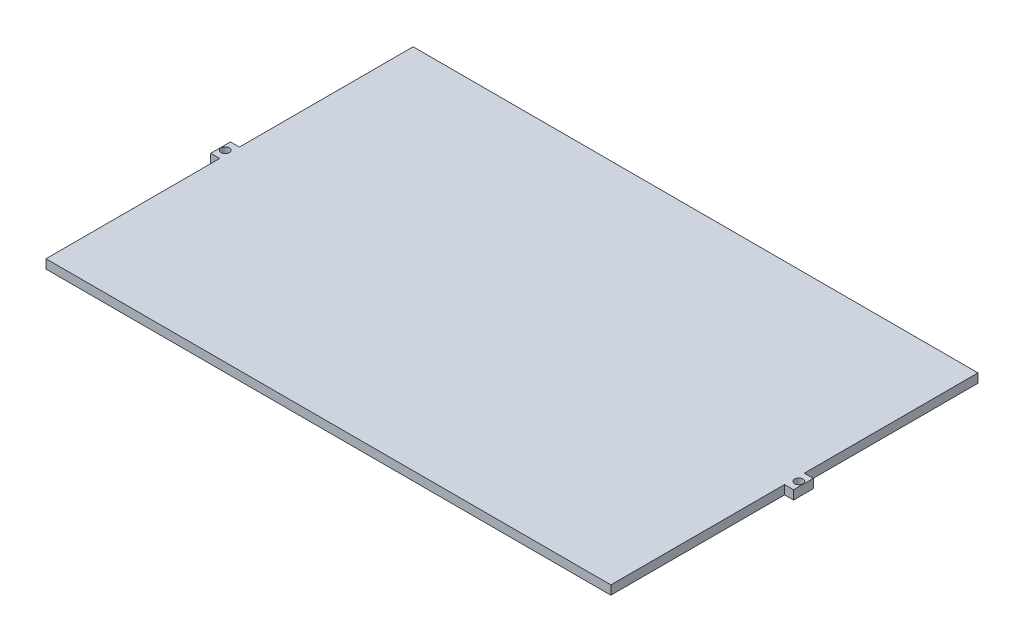
ISO-10303-21;
HEADER;
FILE_DESCRIPTION(('STEP AP214'),'2;1');
FILE_NAME('part.step','',(''),(''),'','','');
FILE_SCHEMA(('AUTOMOTIVE_DESIGN { 1 0 10303 214 1 1 1 1 }'));
ENDSEC;
DATA;
#1=APPLICATION_CONTEXT('core data for automotive mechanical design processes');
#2=APPLICATION_PROTOCOL_DEFINITION('international standard','automotive_design',2000,#1);
#3=PRODUCT_CONTEXT('',#1,'mechanical');
#4=PRODUCT('Part','Part','',(#3));
#5=PRODUCT_RELATED_PRODUCT_CATEGORY('part','',(#4));
#6=PRODUCT_DEFINITION_FORMATION('','',#4);
#7=PRODUCT_DEFINITION_CONTEXT('part definition',#1,'design');
#8=PRODUCT_DEFINITION('design','',#6,#7);
#9=PRODUCT_DEFINITION_SHAPE('','',#8);
#10=(LENGTH_UNIT() NAMED_UNIT(*) SI_UNIT(.MILLI.,.METRE.));
#11=(NAMED_UNIT(*) PLANE_ANGLE_UNIT() SI_UNIT($,.RADIAN.));
#12=(NAMED_UNIT(*) SI_UNIT($,.STERADIAN.) SOLID_ANGLE_UNIT());
#13=UNCERTAINTY_MEASURE_WITH_UNIT(LENGTH_MEASURE(1.E-05),#10,'distance_accuracy_value','');
#14=(GEOMETRIC_REPRESENTATION_CONTEXT(3) GLOBAL_UNCERTAINTY_ASSIGNED_CONTEXT((#13)) GLOBAL_UNIT_ASSIGNED_CONTEXT((#10,
#11,#12)) REPRESENTATION_CONTEXT('',''));
#15=CARTESIAN_POINT('',(0.,0.,0.));
#16=DIRECTION('',(0.,0.,1.));
#17=DIRECTION('',(1.,0.,0.));
#18=AXIS2_PLACEMENT_3D('',#15,#16,#17);
#19=CARTESIAN_POINT('',(99.9999999999999,3.18,-65.));
#20=DIRECTION('',(-1.,0.,0.));
#21=DIRECTION('',(0.,0.,1.));
#22=AXIS2_PLACEMENT_3D('',#19,#20,#21);
#23=PLANE('',#22);
#24=DIRECTION('',(0.,0.,-1.));
#25=VECTOR('',#24,1.);
#26=CARTESIAN_POINT('',(99.9999999999999,3.18,-65.));
#27=LINE('',#26,#25);
#28=CARTESIAN_POINT('',(100.,3.18,-3.49999999999998));
#29=VERTEX_POINT('',#28);
#30=CARTESIAN_POINT('',(99.9999999999999,3.18,-65.));
#31=VERTEX_POINT('',#30);
#32=EDGE_CURVE('E196',#29,#31,#27,.T.);
#33=ORIENTED_EDGE('',*,*,#32,.F.);
#34=DIRECTION('',(0.,-1.,0.));
#35=VECTOR('',#34,1.);
#36=CARTESIAN_POINT('',(100.,0.,-3.49999999999998));
#37=LINE('',#36,#35);
#38=CARTESIAN_POINT('',(100.,0.,-3.49999999999998));
#39=VERTEX_POINT('',#38);
#40=EDGE_CURVE('E131',#29,#39,#37,.T.);
#41=ORIENTED_EDGE('',*,*,#40,.T.);
#42=DIRECTION('',(0.,0.,-1.));
#43=VECTOR('',#42,1.);
#44=CARTESIAN_POINT('',(99.9999999999999,0.,-65.));
#45=LINE('',#44,#43);
#46=CARTESIAN_POINT('',(99.9999999999999,0.,-65.));
#47=VERTEX_POINT('',#46);
#48=EDGE_CURVE('E192',#39,#47,#45,.T.);
#49=ORIENTED_EDGE('',*,*,#48,.T.);
#50=DIRECTION('',(0.,-1.,0.));
#51=VECTOR('',#50,1.);
#52=CARTESIAN_POINT('',(99.9999999999999,3.18,-65.));
#53=LINE('',#52,#51);
#54=EDGE_CURVE('E11',#31,#47,#53,.T.);
#55=ORIENTED_EDGE('',*,*,#54,.F.);
#56=EDGE_LOOP('',(#33,#41,#49,#55));
#57=FACE_BOUND('',#56,.T.);
#58=ADVANCED_FACE('F34',(#57),#23,.F.);
#59=CARTESIAN_POINT('',(-100.,3.18,-65.));
#60=DIRECTION('',(1.,0.,0.));
#61=DIRECTION('',(0.,0.,-1.));
#62=AXIS2_PLACEMENT_3D('',#59,#60,#61);
#63=PLANE('',#62);
#64=DIRECTION('',(0.,-1.,0.));
#65=VECTOR('',#64,1.);
#66=CARTESIAN_POINT('',(-100.,0.,-3.49999999999998));
#67=LINE('',#66,#65);
#68=CARTESIAN_POINT('',(-100.,3.18,-3.49999999999998));
#69=VERTEX_POINT('',#68);
#70=CARTESIAN_POINT('',(-100.,0.,-3.49999999999998));
#71=VERTEX_POINT('',#70);
#72=EDGE_CURVE('E57',#69,#71,#67,.T.);
#73=ORIENTED_EDGE('',*,*,#72,.F.);
#74=DIRECTION('',(0.,0.,1.));
#75=VECTOR('',#74,1.);
#76=CARTESIAN_POINT('',(-100.,3.18,-65.));
#77=LINE('',#76,#75);
#78=CARTESIAN_POINT('',(-100.,3.18,-65.));
#79=VERTEX_POINT('',#78);
#80=EDGE_CURVE('E199',#79,#69,#77,.T.);
#81=ORIENTED_EDGE('',*,*,#80,.F.);
#82=DIRECTION('',(0.,-1.,0.));
#83=VECTOR('',#82,1.);
#84=CARTESIAN_POINT('',(-100.,3.18,-65.));
#85=LINE('',#84,#83);
#86=CARTESIAN_POINT('',(-100.,0.,-65.));
#87=VERTEX_POINT('',#86);
#88=EDGE_CURVE('E42',#79,#87,#85,.T.);
#89=ORIENTED_EDGE('',*,*,#88,.T.);
#90=DIRECTION('',(0.,0.,1.));
#91=VECTOR('',#90,1.);
#92=CARTESIAN_POINT('',(-100.,0.,-65.));
#93=LINE('',#92,#91);
#94=EDGE_CURVE('E210',#87,#71,#93,.T.);
#95=ORIENTED_EDGE('',*,*,#94,.T.);
#96=EDGE_LOOP('',(#73,#81,#89,#95));
#97=FACE_BOUND('',#96,.T.);
#98=ADVANCED_FACE('F221',(#97),#63,.F.);
#99=DIRECTION('',(0.,1.,0.));
#100=VECTOR('',#99,1.);
#101=CARTESIAN_POINT('',(-100.,0.,3.50000000000002));
#102=LINE('',#101,#100);
#103=CARTESIAN_POINT('',(-100.,0.,3.50000000000002));
#104=VERTEX_POINT('',#103);
#105=CARTESIAN_POINT('',(-100.,3.18,3.50000000000002));
#106=VERTEX_POINT('',#105);
#107=EDGE_CURVE('E171',#104,#106,#102,.T.);
#108=ORIENTED_EDGE('',*,*,#107,.F.);
#109=CARTESIAN_POINT('',(-100.,0.,65.));
#110=VERTEX_POINT('',#109);
#111=EDGE_CURVE('E209',#104,#110,#93,.T.);
#112=ORIENTED_EDGE('',*,*,#111,.T.);
#113=DIRECTION('',(0.,-1.,0.));
#114=VECTOR('',#113,1.);
#115=CARTESIAN_POINT('',(-100.,3.18,65.));
#116=LINE('',#115,#114);
#117=CARTESIAN_POINT('',(-100.,3.18,65.));
#118=VERTEX_POINT('',#117);
#119=EDGE_CURVE('E216',#118,#110,#116,.T.);
#120=ORIENTED_EDGE('',*,*,#119,.F.);
#121=EDGE_CURVE('E198',#106,#118,#77,.T.);
#122=ORIENTED_EDGE('',*,*,#121,.F.);
#123=EDGE_LOOP('',(#108,#112,#120,#122));
#124=FACE_BOUND('',#123,.T.);
#125=ADVANCED_FACE('F270',(#124),#63,.F.);
#126=CARTESIAN_POINT('',(100.,0.,65.));
#127=VERTEX_POINT('',#126);
#128=CARTESIAN_POINT('',(100.,0.,3.50000000000002));
#129=VERTEX_POINT('',#128);
#130=EDGE_CURVE('E204',#127,#129,#45,.T.);
#131=ORIENTED_EDGE('',*,*,#130,.T.);
#132=DIRECTION('',(0.,1.,0.));
#133=VECTOR('',#132,1.);
#134=CARTESIAN_POINT('',(100.,0.,3.50000000000002));
#135=LINE('',#134,#133);
#136=CARTESIAN_POINT('',(100.,3.18,3.50000000000002));
#137=VERTEX_POINT('',#136);
#138=EDGE_CURVE('E144',#129,#137,#135,.T.);
#139=ORIENTED_EDGE('',*,*,#138,.T.);
#140=CARTESIAN_POINT('',(100.,3.18,65.));
#141=VERTEX_POINT('',#140);
#142=EDGE_CURVE('E193',#141,#137,#27,.T.);
#143=ORIENTED_EDGE('',*,*,#142,.F.);
#144=DIRECTION('',(0.,-1.,0.));
#145=VECTOR('',#144,1.);
#146=CARTESIAN_POINT('',(100.,3.18,65.));
#147=LINE('',#146,#145);
#148=EDGE_CURVE('E203',#141,#127,#147,.T.);
#149=ORIENTED_EDGE('',*,*,#148,.T.);
#150=EDGE_LOOP('',(#131,#139,#143,#149));
#151=FACE_BOUND('',#150,.T.);
#152=ADVANCED_FACE('F36',(#151),#23,.F.);
#153=CARTESIAN_POINT('',(-100.,3.18,-65.));
#154=DIRECTION('',(0.,0.,1.));
#155=DIRECTION('',(1.,0.,0.));
#156=AXIS2_PLACEMENT_3D('',#153,#154,#155);
#157=PLANE('',#156);
#158=DIRECTION('',(-1.,0.,0.));
#159=VECTOR('',#158,1.);
#160=CARTESIAN_POINT('',(-100.,0.,-65.));
#161=LINE('',#160,#159);
#162=EDGE_CURVE('E207',#47,#87,#161,.T.);
#163=ORIENTED_EDGE('',*,*,#162,.T.);
#164=ORIENTED_EDGE('',*,*,#88,.F.);
#165=DIRECTION('',(-1.,0.,0.));
#166=VECTOR('',#165,1.);
#167=CARTESIAN_POINT('',(-100.,3.18,-65.));
#168=LINE('',#167,#166);
#169=EDGE_CURVE('E195',#31,#79,#168,.T.);
#170=ORIENTED_EDGE('',*,*,#169,.F.);
#171=ORIENTED_EDGE('',*,*,#54,.T.);
#172=EDGE_LOOP('',(#163,#164,#170,#171));
#173=FACE_BOUND('',#172,.T.);
#174=ADVANCED_FACE('F237',(#173),#157,.F.);
#175=CARTESIAN_POINT('',(-100.,3.18,65.));
#176=DIRECTION('',(0.,0.,-1.));
#177=DIRECTION('',(-1.,0.,0.));
#178=AXIS2_PLACEMENT_3D('',#175,#176,#177);
#179=PLANE('',#178);
#180=DIRECTION('',(1.,0.,0.));
#181=VECTOR('',#180,1.);
#182=CARTESIAN_POINT('',(-100.,0.,65.));
#183=LINE('',#182,#181);
#184=EDGE_CURVE('E212',#110,#127,#183,.T.);
#185=ORIENTED_EDGE('',*,*,#184,.T.);
#186=ORIENTED_EDGE('',*,*,#148,.F.);
#187=DIRECTION('',(1.,0.,0.));
#188=VECTOR('',#187,1.);
#189=CARTESIAN_POINT('',(-100.,3.18,65.));
#190=LINE('',#189,#188);
#191=EDGE_CURVE('E201',#118,#141,#190,.T.);
#192=ORIENTED_EDGE('',*,*,#191,.F.);
#193=ORIENTED_EDGE('',*,*,#119,.T.);
#194=EDGE_LOOP('',(#185,#186,#192,#193));
#195=FACE_BOUND('',#194,.T.);
#196=ADVANCED_FACE('F246',(#195),#179,.F.);
#197=CARTESIAN_POINT('',(0.,3.18,0.));
#198=DIRECTION('',(0.,1.,0.));
#199=DIRECTION('',(0.,0.,1.));
#200=AXIS2_PLACEMENT_3D('',#197,#198,#199);
#201=PLANE('',#200);
#202=CARTESIAN_POINT('',(101.55,3.18,0.));
#203=DIRECTION('',(0.,-1.,0.));
#204=DIRECTION('',(0.,0.,1.));
#205=AXIS2_PLACEMENT_3D('',#202,#203,#204);
#206=CIRCLE('',#205,1.46999999999999);
#207=CARTESIAN_POINT('',(101.55,3.18,1.46999999999999));
#208=VERTEX_POINT('',#207);
#209=EDGE_CURVE('E371',#208,#208,#206,.T.);
#210=ORIENTED_EDGE('',*,*,#209,.T.);
#211=EDGE_LOOP('',(#210));
#212=FACE_BOUND('',#211,.T.);
#213=CARTESIAN_POINT('',(-101.55,3.18,0.));
#214=DIRECTION('',(0.,1.,0.));
#215=DIRECTION('',(0.,0.,1.));
#216=AXIS2_PLACEMENT_3D('',#213,#214,#215);
#217=CIRCLE('',#216,1.46999999999999);
#218=CARTESIAN_POINT('',(-101.55,3.18,1.46999999999999));
#219=VERTEX_POINT('',#218);
#220=EDGE_CURVE('E135',#219,#219,#217,.T.);
#221=ORIENTED_EDGE('',*,*,#220,.F.);
#222=EDGE_LOOP('',(#221));
#223=FACE_BOUND('',#222,.T.);
#224=ORIENTED_EDGE('',*,*,#142,.T.);
#225=DIRECTION('',(-1.,0.,0.));
#226=VECTOR('',#225,1.);
#227=CARTESIAN_POINT('',(103.18,3.18,3.50000000000002));
#228=LINE('',#227,#226);
#229=CARTESIAN_POINT('',(103.18,3.18,3.50000000000002));
#230=VERTEX_POINT('',#229);
#231=EDGE_CURVE('E49',#230,#137,#228,.T.);
#232=ORIENTED_EDGE('',*,*,#231,.F.);
#233=DIRECTION('',(0.,0.,-1.));
#234=VECTOR('',#233,1.);
#235=CARTESIAN_POINT('',(103.18,3.18,3.50000000000002));
#236=LINE('',#235,#234);
#237=CARTESIAN_POINT('',(103.18,3.18,-3.49999999999998));
#238=VERTEX_POINT('',#237);
#239=EDGE_CURVE('E141',#230,#238,#236,.T.);
#240=ORIENTED_EDGE('',*,*,#239,.T.);
#241=DIRECTION('',(-1.,0.,0.));
#242=VECTOR('',#241,1.);
#243=CARTESIAN_POINT('',(103.18,3.18,-3.49999999999998));
#244=LINE('',#243,#242);
#245=EDGE_CURVE('E125',#238,#29,#244,.T.);
#246=ORIENTED_EDGE('',*,*,#245,.T.);
#247=ORIENTED_EDGE('',*,*,#32,.T.);
#248=ORIENTED_EDGE('',*,*,#169,.T.);
#249=ORIENTED_EDGE('',*,*,#80,.T.);
#250=DIRECTION('',(1.,0.,0.));
#251=VECTOR('',#250,1.);
#252=CARTESIAN_POINT('',(-103.18,3.18,-3.49999999999998));
#253=LINE('',#252,#251);
#254=CARTESIAN_POINT('',(-103.18,3.18,-3.49999999999998));
#255=VERTEX_POINT('',#254);
#256=EDGE_CURVE('E177',#255,#69,#253,.T.);
#257=ORIENTED_EDGE('',*,*,#256,.F.);
#258=DIRECTION('',(0.,0.,-1.));
#259=VECTOR('',#258,1.);
#260=CARTESIAN_POINT('',(-103.18,3.18,3.50000000000002));
#261=LINE('',#260,#259);
#262=CARTESIAN_POINT('',(-103.18,3.18,3.50000000000002));
#263=VERTEX_POINT('',#262);
#264=EDGE_CURVE('E175',#263,#255,#261,.T.);
#265=ORIENTED_EDGE('',*,*,#264,.F.);
#266=DIRECTION('',(1.,0.,0.));
#267=VECTOR('',#266,1.);
#268=CARTESIAN_POINT('',(-103.18,3.18,3.50000000000002));
#269=LINE('',#268,#267);
#270=EDGE_CURVE('E183',#263,#106,#269,.T.);
#271=ORIENTED_EDGE('',*,*,#270,.T.);
#272=ORIENTED_EDGE('',*,*,#121,.T.);
#273=ORIENTED_EDGE('',*,*,#191,.T.);
#274=EDGE_LOOP('',(#224,#232,#240,#246,#247,#248,#249,#257,#265,#271,#272,#273));
#275=FACE_BOUND('',#274,.T.);
#276=ADVANCED_FACE('F147',(#212,#223,#275),#201,.T.);
#277=CARTESIAN_POINT('',(0.,0.,0.));
#278=DIRECTION('',(0.,1.,0.));
#279=DIRECTION('',(0.,0.,1.));
#280=AXIS2_PLACEMENT_3D('',#277,#278,#279);
#281=PLANE('',#280);
#282=CARTESIAN_POINT('',(101.55,0.,0.));
#283=DIRECTION('',(0.,-1.,0.));
#284=DIRECTION('',(0.,0.,1.));
#285=AXIS2_PLACEMENT_3D('',#282,#283,#284);
#286=CIRCLE('',#285,1.46999999999999);
#287=CARTESIAN_POINT('',(101.55,0.,1.46999999999999));
#288=VERTEX_POINT('',#287);
#289=EDGE_CURVE('E156',#288,#288,#286,.T.);
#290=ORIENTED_EDGE('',*,*,#289,.F.);
#291=EDGE_LOOP('',(#290));
#292=FACE_BOUND('',#291,.T.);
#293=CARTESIAN_POINT('',(-101.55,0.,0.));
#294=DIRECTION('',(0.,1.,0.));
#295=DIRECTION('',(0.,0.,1.));
#296=AXIS2_PLACEMENT_3D('',#293,#294,#295);
#297=CIRCLE('',#296,1.46999999999999);
#298=CARTESIAN_POINT('',(-101.55,0.,1.46999999999999));
#299=VERTEX_POINT('',#298);
#300=EDGE_CURVE('E162',#299,#299,#297,.T.);
#301=ORIENTED_EDGE('',*,*,#300,.T.);
#302=EDGE_LOOP('',(#301));
#303=FACE_BOUND('',#302,.T.);
#304=ORIENTED_EDGE('',*,*,#130,.F.);
#305=ORIENTED_EDGE('',*,*,#184,.F.);
#306=ORIENTED_EDGE('',*,*,#111,.F.);
#307=DIRECTION('',(1.,0.,0.));
#308=VECTOR('',#307,1.);
#309=CARTESIAN_POINT('',(-103.18,0.,3.50000000000002));
#310=LINE('',#309,#308);
#311=CARTESIAN_POINT('',(-103.18,0.,3.50000000000002));
#312=VERTEX_POINT('',#311);
#313=EDGE_CURVE('E186',#312,#104,#310,.T.);
#314=ORIENTED_EDGE('',*,*,#313,.F.);
#315=DIRECTION('',(0.,0.,1.));
#316=VECTOR('',#315,1.);
#317=CARTESIAN_POINT('',(-103.18,0.,3.50000000000002));
#318=LINE('',#317,#316);
#319=CARTESIAN_POINT('',(-103.18,0.,-3.49999999999998));
#320=VERTEX_POINT('',#319);
#321=EDGE_CURVE('E170',#320,#312,#318,.T.);
#322=ORIENTED_EDGE('',*,*,#321,.F.);
#323=DIRECTION('',(1.,0.,0.));
#324=VECTOR('',#323,1.);
#325=CARTESIAN_POINT('',(-103.18,0.,-3.49999999999998));
#326=LINE('',#325,#324);
#327=EDGE_CURVE('E189',#320,#71,#326,.T.);
#328=ORIENTED_EDGE('',*,*,#327,.T.);
#329=ORIENTED_EDGE('',*,*,#94,.F.);
#330=ORIENTED_EDGE('',*,*,#162,.F.);
#331=ORIENTED_EDGE('',*,*,#48,.F.);
#332=DIRECTION('',(-1.,0.,0.));
#333=VECTOR('',#332,1.);
#334=CARTESIAN_POINT('',(103.18,0.,-3.49999999999998));
#335=LINE('',#334,#333);
#336=CARTESIAN_POINT('',(103.18,0.,-3.49999999999998));
#337=VERTEX_POINT('',#336);
#338=EDGE_CURVE('E154',#337,#39,#335,.T.);
#339=ORIENTED_EDGE('',*,*,#338,.F.);
#340=DIRECTION('',(0.,0.,1.));
#341=VECTOR('',#340,1.);
#342=CARTESIAN_POINT('',(103.18,0.,3.50000000000002));
#343=LINE('',#342,#341);
#344=CARTESIAN_POINT('',(103.18,0.,3.50000000000002));
#345=VERTEX_POINT('',#344);
#346=EDGE_CURVE('E143',#337,#345,#343,.T.);
#347=ORIENTED_EDGE('',*,*,#346,.T.);
#348=DIRECTION('',(-1.,0.,0.));
#349=VECTOR('',#348,1.);
#350=CARTESIAN_POINT('',(103.18,0.,3.50000000000002));
#351=LINE('',#350,#349);
#352=EDGE_CURVE('E159',#345,#129,#351,.T.);
#353=ORIENTED_EDGE('',*,*,#352,.T.);
#354=EDGE_LOOP('',(#304,#305,#306,#314,#322,#328,#329,#330,#331,#339,#347,#353));
#355=FACE_BOUND('',#354,.T.);
#356=ADVANCED_FACE('F227',(#292,#303,#355),#281,.F.);
#357=CARTESIAN_POINT('',(-103.18,0.,-3.49999999999998));
#358=DIRECTION('',(0.,0.,1.));
#359=DIRECTION('',(1.,0.,0.));
#360=AXIS2_PLACEMENT_3D('',#357,#358,#359);
#361=PLANE('',#360);
#362=ORIENTED_EDGE('',*,*,#72,.T.);
#363=ORIENTED_EDGE('',*,*,#327,.F.);
#364=DIRECTION('',(0.,-1.,0.));
#365=VECTOR('',#364,1.);
#366=CARTESIAN_POINT('',(-103.18,0.,-3.49999999999998));
#367=LINE('',#366,#365);
#368=EDGE_CURVE('E167',#255,#320,#367,.T.);
#369=ORIENTED_EDGE('',*,*,#368,.F.);
#370=ORIENTED_EDGE('',*,*,#256,.T.);
#371=EDGE_LOOP('',(#362,#363,#369,#370));
#372=FACE_BOUND('',#371,.T.);
#373=ADVANCED_FACE('F233',(#372),#361,.F.);
#374=CARTESIAN_POINT('',(-103.18,0.,3.50000000000002));
#375=DIRECTION('',(0.,0.,-1.));
#376=DIRECTION('',(-1.,0.,0.));
#377=AXIS2_PLACEMENT_3D('',#374,#375,#376);
#378=PLANE('',#377);
#379=ORIENTED_EDGE('',*,*,#107,.T.);
#380=ORIENTED_EDGE('',*,*,#270,.F.);
#381=DIRECTION('',(0.,1.,0.));
#382=VECTOR('',#381,1.);
#383=CARTESIAN_POINT('',(-103.18,0.,3.50000000000002));
#384=LINE('',#383,#382);
#385=EDGE_CURVE('E173',#312,#263,#384,.T.);
#386=ORIENTED_EDGE('',*,*,#385,.F.);
#387=ORIENTED_EDGE('',*,*,#313,.T.);
#388=EDGE_LOOP('',(#379,#380,#386,#387));
#389=FACE_BOUND('',#388,.T.);
#390=ADVANCED_FACE('F252',(#389),#378,.F.);
#391=CARTESIAN_POINT('',(-103.18,0.,0.));
#392=DIRECTION('',(-1.,0.,0.));
#393=DIRECTION('',(0.,0.,1.));
#394=AXIS2_PLACEMENT_3D('',#391,#392,#393);
#395=PLANE('',#394);
#396=ORIENTED_EDGE('',*,*,#368,.T.);
#397=ORIENTED_EDGE('',*,*,#321,.T.);
#398=ORIENTED_EDGE('',*,*,#385,.T.);
#399=ORIENTED_EDGE('',*,*,#264,.T.);
#400=EDGE_LOOP('',(#396,#397,#398,#399));
#401=FACE_BOUND('',#400,.T.);
#402=ADVANCED_FACE('F255',(#401),#395,.T.);
#403=CARTESIAN_POINT('',(-101.55,0.,0.));
#404=DIRECTION('',(0.,1.,0.));
#405=DIRECTION('',(0.,0.,1.));
#406=AXIS2_PLACEMENT_3D('',#403,#404,#405);
#407=CYLINDRICAL_SURFACE('',#406,1.46999999999999);
#408=ORIENTED_EDGE('',*,*,#300,.F.);
#409=EDGE_LOOP('',(#408));
#410=FACE_BOUND('',#409,.T.);
#411=ORIENTED_EDGE('',*,*,#220,.T.);
#412=EDGE_LOOP('',(#411));
#413=FACE_BOUND('',#412,.T.);
#414=ADVANCED_FACE('F257',(#410,#413),#407,.F.);
#415=CARTESIAN_POINT('',(103.18,0.,-3.49999999999998));
#416=DIRECTION('',(0.,0.,-1.));
#417=DIRECTION('',(-1.,0.,0.));
#418=AXIS2_PLACEMENT_3D('',#415,#416,#417);
#419=PLANE('',#418);
#420=ORIENTED_EDGE('',*,*,#40,.F.);
#421=ORIENTED_EDGE('',*,*,#245,.F.);
#422=DIRECTION('',(0.,-1.,0.));
#423=VECTOR('',#422,1.);
#424=CARTESIAN_POINT('',(103.18,0.,-3.49999999999998));
#425=LINE('',#424,#423);
#426=EDGE_CURVE('E128',#238,#337,#425,.T.);
#427=ORIENTED_EDGE('',*,*,#426,.T.);
#428=ORIENTED_EDGE('',*,*,#338,.T.);
#429=EDGE_LOOP('',(#420,#421,#427,#428));
#430=FACE_BOUND('',#429,.T.);
#431=ADVANCED_FACE('F127',(#430),#419,.T.);
#432=CARTESIAN_POINT('',(103.18,0.,3.50000000000002));
#433=DIRECTION('',(0.,0.,1.));
#434=DIRECTION('',(1.,0.,0.));
#435=AXIS2_PLACEMENT_3D('',#432,#433,#434);
#436=PLANE('',#435);
#437=ORIENTED_EDGE('',*,*,#138,.F.);
#438=ORIENTED_EDGE('',*,*,#352,.F.);
#439=DIRECTION('',(0.,1.,0.));
#440=VECTOR('',#439,1.);
#441=CARTESIAN_POINT('',(103.18,0.,3.50000000000002));
#442=LINE('',#441,#440);
#443=EDGE_CURVE('E148',#345,#230,#442,.T.);
#444=ORIENTED_EDGE('',*,*,#443,.T.);
#445=ORIENTED_EDGE('',*,*,#231,.T.);
#446=EDGE_LOOP('',(#437,#438,#444,#445));
#447=FACE_BOUND('',#446,.T.);
#448=ADVANCED_FACE('F240',(#447),#436,.T.);
#449=CARTESIAN_POINT('',(103.18,0.,0.));
#450=DIRECTION('',(1.,0.,0.));
#451=DIRECTION('',(0.,0.,1.));
#452=AXIS2_PLACEMENT_3D('',#449,#450,#451);
#453=PLANE('',#452);
#454=ORIENTED_EDGE('',*,*,#426,.F.);
#455=ORIENTED_EDGE('',*,*,#239,.F.);
#456=ORIENTED_EDGE('',*,*,#443,.F.);
#457=ORIENTED_EDGE('',*,*,#346,.F.);
#458=EDGE_LOOP('',(#454,#455,#456,#457));
#459=FACE_BOUND('',#458,.T.);
#460=ADVANCED_FACE('F139',(#459),#453,.T.);
#461=CARTESIAN_POINT('',(101.55,0.,0.));
#462=DIRECTION('',(0.,1.,0.));
#463=DIRECTION('',(0.,0.,1.));
#464=AXIS2_PLACEMENT_3D('',#461,#462,#463);
#465=CYLINDRICAL_SURFACE('',#464,1.46999999999999);
#466=ORIENTED_EDGE('',*,*,#289,.T.);
#467=EDGE_LOOP('',(#466));
#468=FACE_BOUND('',#467,.T.);
#469=ORIENTED_EDGE('',*,*,#209,.F.);
#470=EDGE_LOOP('',(#469));
#471=FACE_BOUND('',#470,.T.);
#472=ADVANCED_FACE('F353',(#468,#471),#465,.F.);
#473=CLOSED_SHELL('',(#58,#98,#125,#152,#174,#196,#276,#356,#373,#390,#402,#414,#431,#448,#460,#472));
#474=MANIFOLD_SOLID_BREP('B2',#473);
#475=ADVANCED_BREP_SHAPE_REPRESENTATION('',(#18,#474),#14);
#476=SHAPE_DEFINITION_REPRESENTATION(#9,#475);
ENDSEC;
END-ISO-10303-21;
